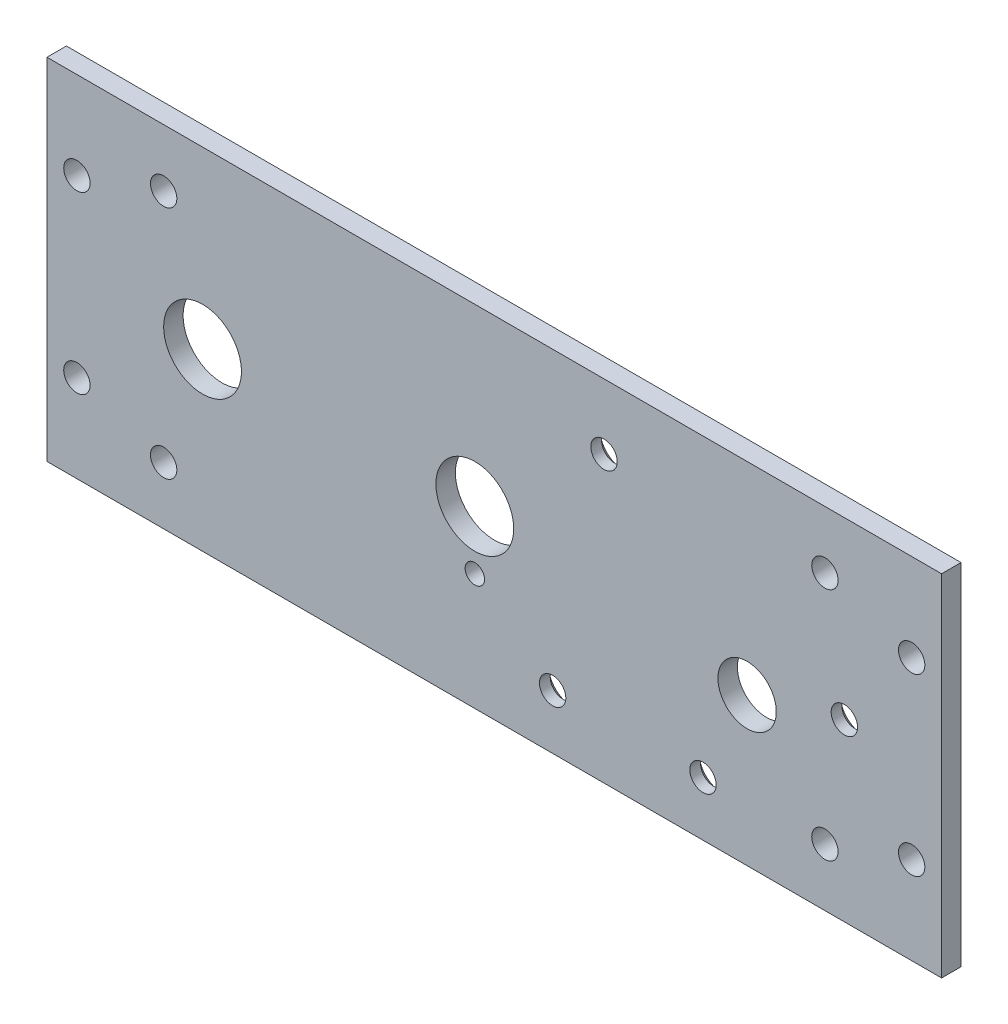
ISO-10303-21;
HEADER;
FILE_DESCRIPTION(('STEP AP214'),'2;1');
FILE_NAME('part.step','',(''),(''),'','','');
FILE_SCHEMA(('AUTOMOTIVE_DESIGN { 1 0 10303 214 1 1 1 1 }'));
ENDSEC;
DATA;
#1=APPLICATION_CONTEXT('core data for automotive mechanical design processes');
#2=APPLICATION_PROTOCOL_DEFINITION('international standard','automotive_design',2000,#1);
#3=PRODUCT_CONTEXT('',#1,'mechanical');
#4=PRODUCT('Part','Part','',(#3));
#5=PRODUCT_RELATED_PRODUCT_CATEGORY('part','',(#4));
#6=PRODUCT_DEFINITION_FORMATION('','',#4);
#7=PRODUCT_DEFINITION_CONTEXT('part definition',#1,'design');
#8=PRODUCT_DEFINITION('design','',#6,#7);
#9=PRODUCT_DEFINITION_SHAPE('','',#8);
#10=(LENGTH_UNIT() NAMED_UNIT(*) SI_UNIT(.MILLI.,.METRE.));
#11=(NAMED_UNIT(*) PLANE_ANGLE_UNIT() SI_UNIT($,.RADIAN.));
#12=(NAMED_UNIT(*) SI_UNIT($,.STERADIAN.) SOLID_ANGLE_UNIT());
#13=UNCERTAINTY_MEASURE_WITH_UNIT(LENGTH_MEASURE(1.E-05),#10,'distance_accuracy_value','');
#14=(GEOMETRIC_REPRESENTATION_CONTEXT(3) GLOBAL_UNCERTAINTY_ASSIGNED_CONTEXT((#13)) GLOBAL_UNIT_ASSIGNED_CONTEXT((#10,
#11,#12)) REPRESENTATION_CONTEXT('',''));
#15=CARTESIAN_POINT('',(0.,0.,0.));
#16=DIRECTION('',(0.,0.,1.));
#17=DIRECTION('',(1.,0.,0.));
#18=AXIS2_PLACEMENT_3D('',#15,#16,#17);
#19=CARTESIAN_POINT('',(0.,0.,-3.175));
#20=DIRECTION('',(1.,0.,0.));
#21=DIRECTION('',(0.,1.,0.));
#22=AXIS2_PLACEMENT_3D('',#19,#20,#21);
#23=PLANE('',#22);
#24=DIRECTION('',(0.,1.,0.));
#25=VECTOR('',#24,1.);
#26=CARTESIAN_POINT('',(0.,0.,0.));
#27=LINE('',#26,#25);
#28=CARTESIAN_POINT('',(0.,0.,0.));
#29=VERTEX_POINT('',#28);
#30=CARTESIAN_POINT('',(0.,57.15,0.));
#31=VERTEX_POINT('',#30);
#32=EDGE_CURVE('E99',#29,#31,#27,.T.);
#33=ORIENTED_EDGE('',*,*,#32,.F.);
#34=DIRECTION('',(0.,0.,1.));
#35=VECTOR('',#34,1.);
#36=CARTESIAN_POINT('',(0.,0.,-3.175));
#37=LINE('',#36,#35);
#38=CARTESIAN_POINT('',(0.,0.,-3.175));
#39=VERTEX_POINT('',#38);
#40=EDGE_CURVE('E11',#39,#29,#37,.T.);
#41=ORIENTED_EDGE('',*,*,#40,.F.);
#42=DIRECTION('',(0.,1.,0.));
#43=VECTOR('',#42,1.);
#44=CARTESIAN_POINT('',(0.,0.,-3.175));
#45=LINE('',#44,#43);
#46=CARTESIAN_POINT('',(0.,57.15,-3.175));
#47=VERTEX_POINT('',#46);
#48=EDGE_CURVE('E92',#39,#47,#45,.T.);
#49=ORIENTED_EDGE('',*,*,#48,.T.);
#50=DIRECTION('',(0.,0.,1.));
#51=VECTOR('',#50,1.);
#52=CARTESIAN_POINT('',(0.,57.15,-3.175));
#53=LINE('',#52,#51);
#54=EDGE_CURVE('E37',#47,#31,#53,.T.);
#55=ORIENTED_EDGE('',*,*,#54,.T.);
#56=EDGE_LOOP('',(#33,#41,#49,#55));
#57=FACE_BOUND('',#56,.T.);
#58=ADVANCED_FACE('F34',(#57),#23,.T.);
#59=CARTESIAN_POINT('',(-146.05,0.,-3.175));
#60=DIRECTION('',(0.,-1.,0.));
#61=DIRECTION('',(1.,0.,0.));
#62=AXIS2_PLACEMENT_3D('',#59,#60,#61);
#63=PLANE('',#62);
#64=DIRECTION('',(1.,0.,0.));
#65=VECTOR('',#64,1.);
#66=CARTESIAN_POINT('',(-146.05,0.,0.));
#67=LINE('',#66,#65);
#68=CARTESIAN_POINT('',(-146.05,0.,0.));
#69=VERTEX_POINT('',#68);
#70=EDGE_CURVE('E94',#69,#29,#67,.T.);
#71=ORIENTED_EDGE('',*,*,#70,.F.);
#72=DIRECTION('',(0.,0.,1.));
#73=VECTOR('',#72,1.);
#74=CARTESIAN_POINT('',(-146.05,0.,-3.175));
#75=LINE('',#74,#73);
#76=CARTESIAN_POINT('',(-146.05,0.,-3.175));
#77=VERTEX_POINT('',#76);
#78=EDGE_CURVE('E43',#77,#69,#75,.T.);
#79=ORIENTED_EDGE('',*,*,#78,.F.);
#80=DIRECTION('',(1.,0.,0.));
#81=VECTOR('',#80,1.);
#82=CARTESIAN_POINT('',(-146.05,0.,-3.175));
#83=LINE('',#82,#81);
#84=EDGE_CURVE('E89',#77,#39,#83,.T.);
#85=ORIENTED_EDGE('',*,*,#84,.T.);
#86=ORIENTED_EDGE('',*,*,#40,.T.);
#87=EDGE_LOOP('',(#71,#79,#85,#86));
#88=FACE_BOUND('',#87,.T.);
#89=ADVANCED_FACE('F110',(#88),#63,.T.);
#90=CARTESIAN_POINT('',(-146.05,57.15,-3.175));
#91=DIRECTION('',(-1.,0.,0.));
#92=DIRECTION('',(0.,0.,1.));
#93=AXIS2_PLACEMENT_3D('',#90,#91,#92);
#94=PLANE('',#93);
#95=DIRECTION('',(0.,-1.,0.));
#96=VECTOR('',#95,1.);
#97=CARTESIAN_POINT('',(-146.05,57.15,0.));
#98=LINE('',#97,#96);
#99=CARTESIAN_POINT('',(-146.05,57.15,0.));
#100=VERTEX_POINT('',#99);
#101=EDGE_CURVE('E84',#100,#69,#98,.T.);
#102=ORIENTED_EDGE('',*,*,#101,.F.);
#103=DIRECTION('',(0.,0.,1.));
#104=VECTOR('',#103,1.);
#105=CARTESIAN_POINT('',(-146.05,57.15,-3.175));
#106=LINE('',#105,#104);
#107=CARTESIAN_POINT('',(-146.05,57.15,-3.175));
#108=VERTEX_POINT('',#107);
#109=EDGE_CURVE('E79',#108,#100,#106,.T.);
#110=ORIENTED_EDGE('',*,*,#109,.F.);
#111=DIRECTION('',(0.,-1.,0.));
#112=VECTOR('',#111,1.);
#113=CARTESIAN_POINT('',(-146.05,57.15,-3.175));
#114=LINE('',#113,#112);
#115=EDGE_CURVE('E82',#108,#77,#114,.T.);
#116=ORIENTED_EDGE('',*,*,#115,.T.);
#117=ORIENTED_EDGE('',*,*,#78,.T.);
#118=EDGE_LOOP('',(#102,#110,#116,#117));
#119=FACE_BOUND('',#118,.T.);
#120=ADVANCED_FACE('F81',(#119),#94,.T.);
#121=CARTESIAN_POINT('',(0.,57.15,-3.175));
#122=DIRECTION('',(0.,1.,0.));
#123=DIRECTION('',(0.,0.,1.));
#124=AXIS2_PLACEMENT_3D('',#121,#122,#123);
#125=PLANE('',#124);
#126=DIRECTION('',(-1.,0.,0.));
#127=VECTOR('',#126,1.);
#128=CARTESIAN_POINT('',(0.,57.15,0.));
#129=LINE('',#128,#127);
#130=EDGE_CURVE('E102',#31,#100,#129,.T.);
#131=ORIENTED_EDGE('',*,*,#130,.F.);
#132=ORIENTED_EDGE('',*,*,#54,.F.);
#133=DIRECTION('',(-1.,0.,0.));
#134=VECTOR('',#133,1.);
#135=CARTESIAN_POINT('',(0.,57.15,-3.175));
#136=LINE('',#135,#134);
#137=EDGE_CURVE('E88',#47,#108,#136,.T.);
#138=ORIENTED_EDGE('',*,*,#137,.T.);
#139=ORIENTED_EDGE('',*,*,#109,.T.);
#140=EDGE_LOOP('',(#131,#132,#138,#139));
#141=FACE_BOUND('',#140,.T.);
#142=ADVANCED_FACE('F91',(#141),#125,.T.);
#143=CARTESIAN_POINT('',(0.,0.,-3.175));
#144=DIRECTION('',(0.,0.,1.));
#145=DIRECTION('',(1.,0.,0.));
#146=AXIS2_PLACEMENT_3D('',#143,#144,#145);
#147=PLANE('',#146);
#148=CARTESIAN_POINT('',(-63.5,8.89,-3.175));
#149=DIRECTION('',(0.,0.,-1.));
#150=DIRECTION('',(-1.,0.,0.));
#151=AXIS2_PLACEMENT_3D('',#148,#149,#150);
#152=CIRCLE('',#151,3.8460045);
#153=CARTESIAN_POINT('',(-67.3460045,8.89,-3.175));
#154=VERTEX_POINT('',#153);
#155=EDGE_CURVE('E218',#154,#154,#152,.T.);
#156=ORIENTED_EDGE('',*,*,#155,.F.);
#157=EDGE_LOOP('',(#156));
#158=FACE_BOUND('',#157,.T.);
#159=CARTESIAN_POINT('',(-55.1079876948826,46.4932869908067,-3.175));
#160=DIRECTION('',(0.,0.,-1.));
#161=DIRECTION('',(-1.,0.,0.));
#162=AXIS2_PLACEMENT_3D('',#159,#160,#161);
#163=CIRCLE('',#162,3.8460045);
#164=CARTESIAN_POINT('',(-58.9539921948826,46.4932869908067,-3.175));
#165=VERTEX_POINT('',#164);
#166=EDGE_CURVE('E225',#165,#165,#163,.T.);
#167=ORIENTED_EDGE('',*,*,#166,.F.);
#168=EDGE_LOOP('',(#167));
#169=FACE_BOUND('',#168,.T.);
#170=CARTESIAN_POINT('',(-15.875,28.58,-3.175));
#171=DIRECTION('',(0.,0.,-1.));
#172=DIRECTION('',(-1.,0.,0.));
#173=AXIS2_PLACEMENT_3D('',#170,#171,#172);
#174=CIRCLE('',#173,3.8460045);
#175=CARTESIAN_POINT('',(-19.7210045,28.58,-3.175));
#176=VERTEX_POINT('',#175);
#177=EDGE_CURVE('E234',#176,#176,#174,.T.);
#178=ORIENTED_EDGE('',*,*,#177,.F.);
#179=EDGE_LOOP('',(#178));
#180=FACE_BOUND('',#179,.T.);
#181=CARTESIAN_POINT('',(-38.95,8.89,-3.175));
#182=DIRECTION('',(0.,0.,-1.));
#183=DIRECTION('',(-1.,0.,0.));
#184=AXIS2_PLACEMENT_3D('',#181,#182,#183);
#185=CIRCLE('',#184,3.8460045);
#186=CARTESIAN_POINT('',(-42.7960045,8.89,-3.175));
#187=VERTEX_POINT('',#186);
#188=EDGE_CURVE('E243',#187,#187,#185,.T.);
#189=ORIENTED_EDGE('',*,*,#188,.F.);
#190=EDGE_LOOP('',(#189));
#191=FACE_BOUND('',#190,.T.);
#192=CARTESIAN_POINT('',(-76.2,19.05,-3.175));
#193=DIRECTION('',(0.,0.,-1.));
#194=DIRECTION('',(-1.,0.,0.));
#195=AXIS2_PLACEMENT_3D('',#192,#193,#194);
#196=CIRCLE('',#195,1.58750000000001);
#197=CARTESIAN_POINT('',(-77.7875,19.05,-3.175));
#198=VERTEX_POINT('',#197);
#199=EDGE_CURVE('E252',#198,#198,#196,.T.);
#200=ORIENTED_EDGE('',*,*,#199,.F.);
#201=EDGE_LOOP('',(#200));
#202=FACE_BOUND('',#201,.T.);
#203=CARTESIAN_POINT('',(-31.75,24.13,-3.175));
#204=DIRECTION('',(0.,0.,-1.));
#205=DIRECTION('',(-1.,0.,0.));
#206=AXIS2_PLACEMENT_3D('',#203,#204,#205);
#207=CIRCLE('',#206,4.7625);
#208=CARTESIAN_POINT('',(-36.5125,24.13,-3.175));
#209=VERTEX_POINT('',#208);
#210=EDGE_CURVE('E258',#209,#209,#207,.T.);
#211=ORIENTED_EDGE('',*,*,#210,.F.);
#212=EDGE_LOOP('',(#211));
#213=FACE_BOUND('',#212,.T.);
#214=CARTESIAN_POINT('',(-76.2000000000001,28.5750000000004,-3.175));
#215=DIRECTION('',(0.,0.,-1.));
#216=DIRECTION('',(-1.,0.,0.));
#217=AXIS2_PLACEMENT_3D('',#214,#215,#216);
#218=CIRCLE('',#217,6.34999999999999);
#219=CARTESIAN_POINT('',(-82.5500000000001,28.5750000000004,-3.175));
#220=VERTEX_POINT('',#219);
#221=EDGE_CURVE('E264',#220,#220,#218,.T.);
#222=ORIENTED_EDGE('',*,*,#221,.F.);
#223=EDGE_LOOP('',(#222));
#224=FACE_BOUND('',#223,.T.);
#225=CARTESIAN_POINT('',(-120.65,28.575,-3.175));
#226=DIRECTION('',(0.,0.,-1.));
#227=DIRECTION('',(-1.,0.,0.));
#228=AXIS2_PLACEMENT_3D('',#225,#226,#227);
#229=CIRCLE('',#228,6.34999999999999);
#230=CARTESIAN_POINT('',(-127.,28.575,-3.175));
#231=VERTEX_POINT('',#230);
#232=EDGE_CURVE('E270',#231,#231,#229,.T.);
#233=ORIENTED_EDGE('',*,*,#232,.F.);
#234=EDGE_LOOP('',(#233));
#235=FACE_BOUND('',#234,.T.);
#236=CARTESIAN_POINT('',(-4.88949999999997,42.8625,-3.175));
#237=DIRECTION('',(0.,0.,-1.));
#238=DIRECTION('',(-1.,0.,0.));
#239=AXIS2_PLACEMENT_3D('',#236,#237,#238);
#240=CIRCLE('',#239,2.15265);
#241=CARTESIAN_POINT('',(-7.04214999999997,42.8625,-3.175));
#242=VERTEX_POINT('',#241);
#243=EDGE_CURVE('E276',#242,#242,#240,.T.);
#244=ORIENTED_EDGE('',*,*,#243,.F.);
#245=EDGE_LOOP('',(#244));
#246=FACE_BOUND('',#245,.T.);
#247=CARTESIAN_POINT('',(-141.1605,42.8625,-3.175));
#248=DIRECTION('',(0.,0.,-1.));
#249=DIRECTION('',(-1.,0.,0.));
#250=AXIS2_PLACEMENT_3D('',#247,#248,#249);
#251=CIRCLE('',#250,2.15265000000001);
#252=CARTESIAN_POINT('',(-143.31315,42.8625,-3.175));
#253=VERTEX_POINT('',#252);
#254=EDGE_CURVE('E282',#253,#253,#251,.T.);
#255=ORIENTED_EDGE('',*,*,#254,.F.);
#256=EDGE_LOOP('',(#255));
#257=FACE_BOUND('',#256,.T.);
#258=CARTESIAN_POINT('',(-141.1605,14.2875,-3.175));
#259=DIRECTION('',(0.,0.,-1.));
#260=DIRECTION('',(-1.,0.,0.));
#261=AXIS2_PLACEMENT_3D('',#258,#259,#260);
#262=CIRCLE('',#261,2.15265000000001);
#263=CARTESIAN_POINT('',(-143.31315,14.2875,-3.175));
#264=VERTEX_POINT('',#263);
#265=EDGE_CURVE('E288',#264,#264,#262,.T.);
#266=ORIENTED_EDGE('',*,*,#265,.F.);
#267=EDGE_LOOP('',(#266));
#268=FACE_BOUND('',#267,.T.);
#269=CARTESIAN_POINT('',(-4.88949999999995,14.2875,-3.175));
#270=DIRECTION('',(0.,0.,-1.));
#271=DIRECTION('',(-1.,0.,0.));
#272=AXIS2_PLACEMENT_3D('',#269,#270,#271);
#273=CIRCLE('',#272,2.15265);
#274=CARTESIAN_POINT('',(-7.04214999999995,14.2875,-3.175));
#275=VERTEX_POINT('',#274);
#276=EDGE_CURVE('E294',#275,#275,#273,.T.);
#277=ORIENTED_EDGE('',*,*,#276,.F.);
#278=EDGE_LOOP('',(#277));
#279=FACE_BOUND('',#278,.T.);
#280=CARTESIAN_POINT('',(-19.05,47.752,-3.175));
#281=DIRECTION('',(0.,0.,-1.));
#282=DIRECTION('',(-1.,0.,0.));
#283=AXIS2_PLACEMENT_3D('',#280,#281,#282);
#284=CIRCLE('',#283,2.15265);
#285=CARTESIAN_POINT('',(-21.20265,47.752,-3.175));
#286=VERTEX_POINT('',#285);
#287=EDGE_CURVE('E300',#286,#286,#284,.T.);
#288=ORIENTED_EDGE('',*,*,#287,.F.);
#289=EDGE_LOOP('',(#288));
#290=FACE_BOUND('',#289,.T.);
#291=CARTESIAN_POINT('',(-19.05,9.398,-3.175));
#292=DIRECTION('',(0.,0.,-1.));
#293=DIRECTION('',(-1.,0.,0.));
#294=AXIS2_PLACEMENT_3D('',#291,#292,#293);
#295=CIRCLE('',#294,2.15265);
#296=CARTESIAN_POINT('',(-21.20265,9.398,-3.175));
#297=VERTEX_POINT('',#296);
#298=EDGE_CURVE('E306',#297,#297,#295,.T.);
#299=ORIENTED_EDGE('',*,*,#298,.F.);
#300=EDGE_LOOP('',(#299));
#301=FACE_BOUND('',#300,.T.);
#302=CARTESIAN_POINT('',(-127.,9.398,-3.175));
#303=DIRECTION('',(0.,0.,-1.));
#304=DIRECTION('',(-1.,0.,0.));
#305=AXIS2_PLACEMENT_3D('',#302,#303,#304);
#306=CIRCLE('',#305,2.15265000000001);
#307=CARTESIAN_POINT('',(-129.15265,9.398,-3.175));
#308=VERTEX_POINT('',#307);
#309=EDGE_CURVE('E312',#308,#308,#306,.T.);
#310=ORIENTED_EDGE('',*,*,#309,.F.);
#311=EDGE_LOOP('',(#310));
#312=FACE_BOUND('',#311,.T.);
#313=CARTESIAN_POINT('',(-127.,47.752,-3.175));
#314=DIRECTION('',(0.,0.,-1.));
#315=DIRECTION('',(-1.,0.,0.));
#316=AXIS2_PLACEMENT_3D('',#313,#314,#315);
#317=CIRCLE('',#316,2.15265000000001);
#318=CARTESIAN_POINT('',(-129.15265,47.752,-3.175));
#319=VERTEX_POINT('',#318);
#320=EDGE_CURVE('E318',#319,#319,#317,.T.);
#321=ORIENTED_EDGE('',*,*,#320,.F.);
#322=EDGE_LOOP('',(#321));
#323=FACE_BOUND('',#322,.T.);
#324=ORIENTED_EDGE('',*,*,#48,.F.);
#325=ORIENTED_EDGE('',*,*,#84,.F.);
#326=ORIENTED_EDGE('',*,*,#115,.F.);
#327=ORIENTED_EDGE('',*,*,#137,.F.);
#328=EDGE_LOOP('',(#324,#325,#326,#327));
#329=FACE_BOUND('',#328,.T.);
#330=ADVANCED_FACE('F87',(#158,#169,#180,#191,#202,#213,#224,#235,#246,#257,#268,#279,#290,#301,
#312,#323,#329),#147,.F.);
#331=CARTESIAN_POINT('',(0.,0.,0.));
#332=DIRECTION('',(0.,0.,1.));
#333=DIRECTION('',(1.,0.,0.));
#334=AXIS2_PLACEMENT_3D('',#331,#332,#333);
#335=PLANE('',#334);
#336=CARTESIAN_POINT('',(-63.5,8.89,0.));
#337=DIRECTION('',(0.,0.,-1.));
#338=DIRECTION('',(-1.,0.,0.));
#339=AXIS2_PLACEMENT_3D('',#336,#337,#338);
#340=CIRCLE('',#339,2.15265);
#341=CARTESIAN_POINT('',(-65.65265,8.89,0.));
#342=VERTEX_POINT('',#341);
#343=EDGE_CURVE('E220',#342,#342,#340,.T.);
#344=ORIENTED_EDGE('',*,*,#343,.T.);
#345=EDGE_LOOP('',(#344));
#346=FACE_BOUND('',#345,.T.);
#347=CARTESIAN_POINT('',(-55.1079876948826,46.4932869908067,0.));
#348=DIRECTION('',(0.,0.,-1.));
#349=DIRECTION('',(-1.,0.,0.));
#350=AXIS2_PLACEMENT_3D('',#347,#348,#349);
#351=CIRCLE('',#350,2.15265);
#352=CARTESIAN_POINT('',(-57.2606376948826,46.4932869908067,0.));
#353=VERTEX_POINT('',#352);
#354=EDGE_CURVE('E231',#353,#353,#351,.T.);
#355=ORIENTED_EDGE('',*,*,#354,.T.);
#356=EDGE_LOOP('',(#355));
#357=FACE_BOUND('',#356,.T.);
#358=CARTESIAN_POINT('',(-15.875,28.58,0.));
#359=DIRECTION('',(0.,0.,-1.));
#360=DIRECTION('',(-1.,0.,0.));
#361=AXIS2_PLACEMENT_3D('',#358,#359,#360);
#362=CIRCLE('',#361,2.15265);
#363=CARTESIAN_POINT('',(-18.02765,28.58,0.));
#364=VERTEX_POINT('',#363);
#365=EDGE_CURVE('E240',#364,#364,#362,.T.);
#366=ORIENTED_EDGE('',*,*,#365,.T.);
#367=EDGE_LOOP('',(#366));
#368=FACE_BOUND('',#367,.T.);
#369=CARTESIAN_POINT('',(-38.95,8.89,0.));
#370=DIRECTION('',(0.,0.,-1.));
#371=DIRECTION('',(-1.,0.,0.));
#372=AXIS2_PLACEMENT_3D('',#369,#370,#371);
#373=CIRCLE('',#372,2.15265);
#374=CARTESIAN_POINT('',(-41.10265,8.89,0.));
#375=VERTEX_POINT('',#374);
#376=EDGE_CURVE('E249',#375,#375,#373,.T.);
#377=ORIENTED_EDGE('',*,*,#376,.T.);
#378=EDGE_LOOP('',(#377));
#379=FACE_BOUND('',#378,.T.);
#380=CARTESIAN_POINT('',(-76.2,19.05,0.));
#381=DIRECTION('',(0.,0.,-1.));
#382=DIRECTION('',(-1.,0.,0.));
#383=AXIS2_PLACEMENT_3D('',#380,#381,#382);
#384=CIRCLE('',#383,1.58750000000001);
#385=CARTESIAN_POINT('',(-77.7875,19.05,0.));
#386=VERTEX_POINT('',#385);
#387=EDGE_CURVE('E255',#386,#386,#384,.T.);
#388=ORIENTED_EDGE('',*,*,#387,.T.);
#389=EDGE_LOOP('',(#388));
#390=FACE_BOUND('',#389,.T.);
#391=CARTESIAN_POINT('',(-31.75,24.13,0.));
#392=DIRECTION('',(0.,0.,-1.));
#393=DIRECTION('',(-1.,0.,0.));
#394=AXIS2_PLACEMENT_3D('',#391,#392,#393);
#395=CIRCLE('',#394,4.7625);
#396=CARTESIAN_POINT('',(-36.5125,24.13,0.));
#397=VERTEX_POINT('',#396);
#398=EDGE_CURVE('E261',#397,#397,#395,.T.);
#399=ORIENTED_EDGE('',*,*,#398,.T.);
#400=EDGE_LOOP('',(#399));
#401=FACE_BOUND('',#400,.T.);
#402=CARTESIAN_POINT('',(-76.2000000000001,28.5750000000004,0.));
#403=DIRECTION('',(0.,0.,-1.));
#404=DIRECTION('',(-1.,0.,0.));
#405=AXIS2_PLACEMENT_3D('',#402,#403,#404);
#406=CIRCLE('',#405,6.34999999999999);
#407=CARTESIAN_POINT('',(-82.5500000000001,28.5750000000004,0.));
#408=VERTEX_POINT('',#407);
#409=EDGE_CURVE('E267',#408,#408,#406,.T.);
#410=ORIENTED_EDGE('',*,*,#409,.T.);
#411=EDGE_LOOP('',(#410));
#412=FACE_BOUND('',#411,.T.);
#413=CARTESIAN_POINT('',(-120.65,28.575,0.));
#414=DIRECTION('',(0.,0.,-1.));
#415=DIRECTION('',(-1.,0.,0.));
#416=AXIS2_PLACEMENT_3D('',#413,#414,#415);
#417=CIRCLE('',#416,6.34999999999999);
#418=CARTESIAN_POINT('',(-127.,28.575,0.));
#419=VERTEX_POINT('',#418);
#420=EDGE_CURVE('E273',#419,#419,#417,.T.);
#421=ORIENTED_EDGE('',*,*,#420,.T.);
#422=EDGE_LOOP('',(#421));
#423=FACE_BOUND('',#422,.T.);
#424=CARTESIAN_POINT('',(-4.88949999999997,42.8625,0.));
#425=DIRECTION('',(0.,0.,-1.));
#426=DIRECTION('',(-1.,0.,0.));
#427=AXIS2_PLACEMENT_3D('',#424,#425,#426);
#428=CIRCLE('',#427,2.15265);
#429=CARTESIAN_POINT('',(-7.04214999999997,42.8625,0.));
#430=VERTEX_POINT('',#429);
#431=EDGE_CURVE('E279',#430,#430,#428,.T.);
#432=ORIENTED_EDGE('',*,*,#431,.T.);
#433=EDGE_LOOP('',(#432));
#434=FACE_BOUND('',#433,.T.);
#435=CARTESIAN_POINT('',(-141.1605,42.8625,0.));
#436=DIRECTION('',(0.,0.,-1.));
#437=DIRECTION('',(-1.,0.,0.));
#438=AXIS2_PLACEMENT_3D('',#435,#436,#437);
#439=CIRCLE('',#438,2.15265000000001);
#440=CARTESIAN_POINT('',(-143.31315,42.8625,0.));
#441=VERTEX_POINT('',#440);
#442=EDGE_CURVE('E285',#441,#441,#439,.T.);
#443=ORIENTED_EDGE('',*,*,#442,.T.);
#444=EDGE_LOOP('',(#443));
#445=FACE_BOUND('',#444,.T.);
#446=CARTESIAN_POINT('',(-141.1605,14.2875,0.));
#447=DIRECTION('',(0.,0.,-1.));
#448=DIRECTION('',(-1.,0.,0.));
#449=AXIS2_PLACEMENT_3D('',#446,#447,#448);
#450=CIRCLE('',#449,2.15265000000001);
#451=CARTESIAN_POINT('',(-143.31315,14.2875,0.));
#452=VERTEX_POINT('',#451);
#453=EDGE_CURVE('E291',#452,#452,#450,.T.);
#454=ORIENTED_EDGE('',*,*,#453,.T.);
#455=EDGE_LOOP('',(#454));
#456=FACE_BOUND('',#455,.T.);
#457=CARTESIAN_POINT('',(-4.88949999999995,14.2875,0.));
#458=DIRECTION('',(0.,0.,-1.));
#459=DIRECTION('',(-1.,0.,0.));
#460=AXIS2_PLACEMENT_3D('',#457,#458,#459);
#461=CIRCLE('',#460,2.15265);
#462=CARTESIAN_POINT('',(-7.04214999999995,14.2875,0.));
#463=VERTEX_POINT('',#462);
#464=EDGE_CURVE('E297',#463,#463,#461,.T.);
#465=ORIENTED_EDGE('',*,*,#464,.T.);
#466=EDGE_LOOP('',(#465));
#467=FACE_BOUND('',#466,.T.);
#468=CARTESIAN_POINT('',(-19.05,47.752,0.));
#469=DIRECTION('',(0.,0.,-1.));
#470=DIRECTION('',(-1.,0.,0.));
#471=AXIS2_PLACEMENT_3D('',#468,#469,#470);
#472=CIRCLE('',#471,2.15265);
#473=CARTESIAN_POINT('',(-21.20265,47.752,0.));
#474=VERTEX_POINT('',#473);
#475=EDGE_CURVE('E303',#474,#474,#472,.T.);
#476=ORIENTED_EDGE('',*,*,#475,.T.);
#477=EDGE_LOOP('',(#476));
#478=FACE_BOUND('',#477,.T.);
#479=CARTESIAN_POINT('',(-19.05,9.398,0.));
#480=DIRECTION('',(0.,0.,-1.));
#481=DIRECTION('',(-1.,0.,0.));
#482=AXIS2_PLACEMENT_3D('',#479,#480,#481);
#483=CIRCLE('',#482,2.15265);
#484=CARTESIAN_POINT('',(-21.20265,9.398,0.));
#485=VERTEX_POINT('',#484);
#486=EDGE_CURVE('E309',#485,#485,#483,.T.);
#487=ORIENTED_EDGE('',*,*,#486,.T.);
#488=EDGE_LOOP('',(#487));
#489=FACE_BOUND('',#488,.T.);
#490=CARTESIAN_POINT('',(-127.,9.398,0.));
#491=DIRECTION('',(0.,0.,-1.));
#492=DIRECTION('',(-1.,0.,0.));
#493=AXIS2_PLACEMENT_3D('',#490,#491,#492);
#494=CIRCLE('',#493,2.15265000000001);
#495=CARTESIAN_POINT('',(-129.15265,9.398,0.));
#496=VERTEX_POINT('',#495);
#497=EDGE_CURVE('E315',#496,#496,#494,.T.);
#498=ORIENTED_EDGE('',*,*,#497,.T.);
#499=EDGE_LOOP('',(#498));
#500=FACE_BOUND('',#499,.T.);
#501=CARTESIAN_POINT('',(-127.,47.752,0.));
#502=DIRECTION('',(0.,0.,-1.));
#503=DIRECTION('',(-1.,0.,0.));
#504=AXIS2_PLACEMENT_3D('',#501,#502,#503);
#505=CIRCLE('',#504,2.15265000000001);
#506=CARTESIAN_POINT('',(-129.15265,47.752,0.));
#507=VERTEX_POINT('',#506);
#508=EDGE_CURVE('E103',#507,#507,#505,.T.);
#509=ORIENTED_EDGE('',*,*,#508,.T.);
#510=EDGE_LOOP('',(#509));
#511=FACE_BOUND('',#510,.T.);
#512=ORIENTED_EDGE('',*,*,#32,.T.);
#513=ORIENTED_EDGE('',*,*,#130,.T.);
#514=ORIENTED_EDGE('',*,*,#101,.T.);
#515=ORIENTED_EDGE('',*,*,#70,.T.);
#516=EDGE_LOOP('',(#512,#513,#514,#515));
#517=FACE_BOUND('',#516,.T.);
#518=ADVANCED_FACE('F109',(#346,#357,#368,#379,#390,#401,#412,#423,#434,#445,#456,#467,#478,
#489,#500,#511,#517),#335,.T.);
#519=CARTESIAN_POINT('',(-127.,47.752,-3.175));
#520=DIRECTION('',(0.,0.,-1.));
#521=DIRECTION('',(-1.,0.,0.));
#522=AXIS2_PLACEMENT_3D('',#519,#520,#521);
#523=CYLINDRICAL_SURFACE('',#522,2.15265000000001);
#524=ORIENTED_EDGE('',*,*,#508,.F.);
#525=EDGE_LOOP('',(#524));
#526=FACE_BOUND('',#525,.T.);
#527=ORIENTED_EDGE('',*,*,#320,.T.);
#528=EDGE_LOOP('',(#527));
#529=FACE_BOUND('',#528,.T.);
#530=ADVANCED_FACE('F128',(#526,#529),#523,.F.);
#531=CARTESIAN_POINT('',(-127.,9.398,-3.175));
#532=DIRECTION('',(0.,0.,-1.));
#533=DIRECTION('',(-1.,0.,0.));
#534=AXIS2_PLACEMENT_3D('',#531,#532,#533);
#535=CYLINDRICAL_SURFACE('',#534,2.15265000000001);
#536=ORIENTED_EDGE('',*,*,#497,.F.);
#537=EDGE_LOOP('',(#536));
#538=FACE_BOUND('',#537,.T.);
#539=ORIENTED_EDGE('',*,*,#309,.T.);
#540=EDGE_LOOP('',(#539));
#541=FACE_BOUND('',#540,.T.);
#542=ADVANCED_FACE('F135',(#538,#541),#535,.F.);
#543=CARTESIAN_POINT('',(-19.05,9.398,-3.175));
#544=DIRECTION('',(0.,0.,-1.));
#545=DIRECTION('',(-1.,0.,0.));
#546=AXIS2_PLACEMENT_3D('',#543,#544,#545);
#547=CYLINDRICAL_SURFACE('',#546,2.15265);
#548=ORIENTED_EDGE('',*,*,#486,.F.);
#549=EDGE_LOOP('',(#548));
#550=FACE_BOUND('',#549,.T.);
#551=ORIENTED_EDGE('',*,*,#298,.T.);
#552=EDGE_LOOP('',(#551));
#553=FACE_BOUND('',#552,.T.);
#554=ADVANCED_FACE('F139',(#550,#553),#547,.F.);
#555=CARTESIAN_POINT('',(-19.05,47.752,-3.175));
#556=DIRECTION('',(0.,0.,-1.));
#557=DIRECTION('',(-1.,0.,0.));
#558=AXIS2_PLACEMENT_3D('',#555,#556,#557);
#559=CYLINDRICAL_SURFACE('',#558,2.15265);
#560=ORIENTED_EDGE('',*,*,#475,.F.);
#561=EDGE_LOOP('',(#560));
#562=FACE_BOUND('',#561,.T.);
#563=ORIENTED_EDGE('',*,*,#287,.T.);
#564=EDGE_LOOP('',(#563));
#565=FACE_BOUND('',#564,.T.);
#566=ADVANCED_FACE('F143',(#562,#565),#559,.F.);
#567=CARTESIAN_POINT('',(-4.88949999999995,14.2875,-3.175));
#568=DIRECTION('',(0.,0.,-1.));
#569=DIRECTION('',(-1.,0.,0.));
#570=AXIS2_PLACEMENT_3D('',#567,#568,#569);
#571=CYLINDRICAL_SURFACE('',#570,2.15265);
#572=ORIENTED_EDGE('',*,*,#464,.F.);
#573=EDGE_LOOP('',(#572));
#574=FACE_BOUND('',#573,.T.);
#575=ORIENTED_EDGE('',*,*,#276,.T.);
#576=EDGE_LOOP('',(#575));
#577=FACE_BOUND('',#576,.T.);
#578=ADVANCED_FACE('F147',(#574,#577),#571,.F.);
#579=CARTESIAN_POINT('',(-141.1605,14.2875,-3.175));
#580=DIRECTION('',(0.,0.,-1.));
#581=DIRECTION('',(-1.,0.,0.));
#582=AXIS2_PLACEMENT_3D('',#579,#580,#581);
#583=CYLINDRICAL_SURFACE('',#582,2.15265000000001);
#584=ORIENTED_EDGE('',*,*,#453,.F.);
#585=EDGE_LOOP('',(#584));
#586=FACE_BOUND('',#585,.T.);
#587=ORIENTED_EDGE('',*,*,#265,.T.);
#588=EDGE_LOOP('',(#587));
#589=FACE_BOUND('',#588,.T.);
#590=ADVANCED_FACE('F151',(#586,#589),#583,.F.);
#591=CARTESIAN_POINT('',(-141.1605,42.8625,-3.175));
#592=DIRECTION('',(0.,0.,-1.));
#593=DIRECTION('',(-1.,0.,0.));
#594=AXIS2_PLACEMENT_3D('',#591,#592,#593);
#595=CYLINDRICAL_SURFACE('',#594,2.15265000000001);
#596=ORIENTED_EDGE('',*,*,#442,.F.);
#597=EDGE_LOOP('',(#596));
#598=FACE_BOUND('',#597,.T.);
#599=ORIENTED_EDGE('',*,*,#254,.T.);
#600=EDGE_LOOP('',(#599));
#601=FACE_BOUND('',#600,.T.);
#602=ADVANCED_FACE('F155',(#598,#601),#595,.F.);
#603=CARTESIAN_POINT('',(-4.88949999999997,42.8625,-3.175));
#604=DIRECTION('',(0.,0.,-1.));
#605=DIRECTION('',(-1.,0.,0.));
#606=AXIS2_PLACEMENT_3D('',#603,#604,#605);
#607=CYLINDRICAL_SURFACE('',#606,2.15265);
#608=ORIENTED_EDGE('',*,*,#431,.F.);
#609=EDGE_LOOP('',(#608));
#610=FACE_BOUND('',#609,.T.);
#611=ORIENTED_EDGE('',*,*,#243,.T.);
#612=EDGE_LOOP('',(#611));
#613=FACE_BOUND('',#612,.T.);
#614=ADVANCED_FACE('F159',(#610,#613),#607,.F.);
#615=CARTESIAN_POINT('',(-120.65,28.575,-3.175));
#616=DIRECTION('',(0.,0.,-1.));
#617=DIRECTION('',(-1.,0.,0.));
#618=AXIS2_PLACEMENT_3D('',#615,#616,#617);
#619=CYLINDRICAL_SURFACE('',#618,6.34999999999999);
#620=ORIENTED_EDGE('',*,*,#420,.F.);
#621=EDGE_LOOP('',(#620));
#622=FACE_BOUND('',#621,.T.);
#623=ORIENTED_EDGE('',*,*,#232,.T.);
#624=EDGE_LOOP('',(#623));
#625=FACE_BOUND('',#624,.T.);
#626=ADVANCED_FACE('F163',(#622,#625),#619,.F.);
#627=CARTESIAN_POINT('',(-76.2000000000001,28.5750000000004,-3.175));
#628=DIRECTION('',(0.,0.,-1.));
#629=DIRECTION('',(-1.,0.,0.));
#630=AXIS2_PLACEMENT_3D('',#627,#628,#629);
#631=CYLINDRICAL_SURFACE('',#630,6.34999999999999);
#632=ORIENTED_EDGE('',*,*,#409,.F.);
#633=EDGE_LOOP('',(#632));
#634=FACE_BOUND('',#633,.T.);
#635=ORIENTED_EDGE('',*,*,#221,.T.);
#636=EDGE_LOOP('',(#635));
#637=FACE_BOUND('',#636,.T.);
#638=ADVANCED_FACE('F167',(#634,#637),#631,.F.);
#639=CARTESIAN_POINT('',(-31.75,24.13,-3.175));
#640=DIRECTION('',(0.,0.,-1.));
#641=DIRECTION('',(-1.,0.,0.));
#642=AXIS2_PLACEMENT_3D('',#639,#640,#641);
#643=CYLINDRICAL_SURFACE('',#642,4.7625);
#644=ORIENTED_EDGE('',*,*,#398,.F.);
#645=EDGE_LOOP('',(#644));
#646=FACE_BOUND('',#645,.T.);
#647=ORIENTED_EDGE('',*,*,#210,.T.);
#648=EDGE_LOOP('',(#647));
#649=FACE_BOUND('',#648,.T.);
#650=ADVANCED_FACE('F171',(#646,#649),#643,.F.);
#651=CARTESIAN_POINT('',(-76.2,19.05,-3.175));
#652=DIRECTION('',(0.,0.,-1.));
#653=DIRECTION('',(-1.,0.,0.));
#654=AXIS2_PLACEMENT_3D('',#651,#652,#653);
#655=CYLINDRICAL_SURFACE('',#654,1.58750000000001);
#656=ORIENTED_EDGE('',*,*,#387,.F.);
#657=EDGE_LOOP('',(#656));
#658=FACE_BOUND('',#657,.T.);
#659=ORIENTED_EDGE('',*,*,#199,.T.);
#660=EDGE_LOOP('',(#659));
#661=FACE_BOUND('',#660,.T.);
#662=ADVANCED_FACE('F175',(#658,#661),#655,.F.);
#663=CARTESIAN_POINT('',(-38.95,8.89,-3.175));
#664=DIRECTION('',(0.,0.,-1.));
#665=DIRECTION('',(-1.,0.,0.));
#666=AXIS2_PLACEMENT_3D('',#663,#664,#665);
#667=CYLINDRICAL_SURFACE('',#666,2.15265);
#668=ORIENTED_EDGE('',*,*,#376,.F.);
#669=EDGE_LOOP('',(#668));
#670=FACE_BOUND('',#669,.T.);
#671=CARTESIAN_POINT('',(-38.95,8.89,-1.7541068635976));
#672=DIRECTION('',(0.,0.,-1.));
#673=DIRECTION('',(-1.,0.,0.));
#674=AXIS2_PLACEMENT_3D('',#671,#672,#673);
#675=CIRCLE('',#674,2.15264999999999);
#676=CARTESIAN_POINT('',(-41.10265,8.89,-1.7541068635976));
#677=VERTEX_POINT('',#676);
#678=EDGE_CURVE('E246',#677,#677,#675,.T.);
#679=ORIENTED_EDGE('',*,*,#678,.T.);
#680=EDGE_LOOP('',(#679));
#681=FACE_BOUND('',#680,.T.);
#682=ADVANCED_FACE('F179',(#670,#681),#667,.F.);
#683=CARTESIAN_POINT('',(-38.95,8.89,-3.175));
#684=DIRECTION('',(0.,0.,-1.));
#685=DIRECTION('',(-1.,0.,0.));
#686=AXIS2_PLACEMENT_3D('',#683,#684,#685);
#687=CONICAL_SURFACE('',#686,3.8460045,0.872664625997164);
#688=ORIENTED_EDGE('',*,*,#678,.F.);
#689=EDGE_LOOP('',(#688));
#690=FACE_BOUND('',#689,.T.);
#691=ORIENTED_EDGE('',*,*,#188,.T.);
#692=EDGE_LOOP('',(#691));
#693=FACE_BOUND('',#692,.T.);
#694=ADVANCED_FACE('F183',(#690,#693),#687,.F.);
#695=CARTESIAN_POINT('',(-15.875,28.58,-3.175));
#696=DIRECTION('',(0.,0.,-1.));
#697=DIRECTION('',(-1.,0.,0.));
#698=AXIS2_PLACEMENT_3D('',#695,#696,#697);
#699=CYLINDRICAL_SURFACE('',#698,2.15264999999999);
#700=ORIENTED_EDGE('',*,*,#365,.F.);
#701=EDGE_LOOP('',(#700));
#702=FACE_BOUND('',#701,.T.);
#703=CARTESIAN_POINT('',(-15.875,28.58,-1.7541068635976));
#704=DIRECTION('',(0.,0.,-1.));
#705=DIRECTION('',(-1.,0.,0.));
#706=AXIS2_PLACEMENT_3D('',#703,#704,#705);
#707=CIRCLE('',#706,2.15264999999999);
#708=CARTESIAN_POINT('',(-18.02765,28.58,-1.7541068635976));
#709=VERTEX_POINT('',#708);
#710=EDGE_CURVE('E237',#709,#709,#707,.T.);
#711=ORIENTED_EDGE('',*,*,#710,.T.);
#712=EDGE_LOOP('',(#711));
#713=FACE_BOUND('',#712,.T.);
#714=ADVANCED_FACE('F187',(#702,#713),#699,.F.);
#715=CARTESIAN_POINT('',(-15.875,28.58,-3.175));
#716=DIRECTION('',(0.,0.,-1.));
#717=DIRECTION('',(-1.,0.,0.));
#718=AXIS2_PLACEMENT_3D('',#715,#716,#717);
#719=CONICAL_SURFACE('',#718,3.8460045,0.872664625997165);
#720=ORIENTED_EDGE('',*,*,#710,.F.);
#721=EDGE_LOOP('',(#720));
#722=FACE_BOUND('',#721,.T.);
#723=ORIENTED_EDGE('',*,*,#177,.T.);
#724=EDGE_LOOP('',(#723));
#725=FACE_BOUND('',#724,.T.);
#726=ADVANCED_FACE('F191',(#722,#725),#719,.F.);
#727=CARTESIAN_POINT('',(-55.1079876948826,46.4932869908067,-3.175));
#728=DIRECTION('',(0.,0.,-1.));
#729=DIRECTION('',(-1.,0.,0.));
#730=AXIS2_PLACEMENT_3D('',#727,#728,#729);
#731=CYLINDRICAL_SURFACE('',#730,2.15265);
#732=ORIENTED_EDGE('',*,*,#354,.F.);
#733=EDGE_LOOP('',(#732));
#734=FACE_BOUND('',#733,.T.);
#735=CARTESIAN_POINT('',(-55.1079876948826,46.4932869908067,-1.7541068635976));
#736=DIRECTION('',(0.,0.,-1.));
#737=DIRECTION('',(-1.,0.,0.));
#738=AXIS2_PLACEMENT_3D('',#735,#736,#737);
#739=CIRCLE('',#738,2.15264999999999);
#740=CARTESIAN_POINT('',(-57.2606376948826,46.4932869908067,-1.7541068635976));
#741=VERTEX_POINT('',#740);
#742=EDGE_CURVE('E228',#741,#741,#739,.T.);
#743=ORIENTED_EDGE('',*,*,#742,.T.);
#744=EDGE_LOOP('',(#743));
#745=FACE_BOUND('',#744,.T.);
#746=ADVANCED_FACE('F195',(#734,#745),#731,.F.);
#747=CARTESIAN_POINT('',(-55.1079876948826,46.4932869908067,-3.175));
#748=DIRECTION('',(0.,0.,-1.));
#749=DIRECTION('',(-1.,0.,0.));
#750=AXIS2_PLACEMENT_3D('',#747,#748,#749);
#751=CONICAL_SURFACE('',#750,3.8460045,0.872664625997164);
#752=ORIENTED_EDGE('',*,*,#742,.F.);
#753=EDGE_LOOP('',(#752));
#754=FACE_BOUND('',#753,.T.);
#755=ORIENTED_EDGE('',*,*,#166,.T.);
#756=EDGE_LOOP('',(#755));
#757=FACE_BOUND('',#756,.T.);
#758=ADVANCED_FACE('F199',(#754,#757),#751,.F.);
#759=CARTESIAN_POINT('',(-63.5,8.89,-3.175));
#760=DIRECTION('',(0.,0.,-1.));
#761=DIRECTION('',(-1.,0.,0.));
#762=AXIS2_PLACEMENT_3D('',#759,#760,#761);
#763=CYLINDRICAL_SURFACE('',#762,2.15265);
#764=ORIENTED_EDGE('',*,*,#343,.F.);
#765=EDGE_LOOP('',(#764));
#766=FACE_BOUND('',#765,.T.);
#767=CARTESIAN_POINT('',(-63.5,8.89,-1.7541068635976));
#768=DIRECTION('',(0.,0.,-1.));
#769=DIRECTION('',(-1.,0.,0.));
#770=AXIS2_PLACEMENT_3D('',#767,#768,#769);
#771=CIRCLE('',#770,2.15264999999999);
#772=CARTESIAN_POINT('',(-65.65265,8.89,-1.7541068635976));
#773=VERTEX_POINT('',#772);
#774=EDGE_CURVE('E216',#773,#773,#771,.T.);
#775=ORIENTED_EDGE('',*,*,#774,.T.);
#776=EDGE_LOOP('',(#775));
#777=FACE_BOUND('',#776,.T.);
#778=ADVANCED_FACE('F203',(#766,#777),#763,.F.);
#779=CARTESIAN_POINT('',(-63.5,8.89,-3.175));
#780=DIRECTION('',(0.,0.,-1.));
#781=DIRECTION('',(-1.,0.,0.));
#782=AXIS2_PLACEMENT_3D('',#779,#780,#781);
#783=CONICAL_SURFACE('',#782,3.8460045,0.872664625997164);
#784=ORIENTED_EDGE('',*,*,#774,.F.);
#785=EDGE_LOOP('',(#784));
#786=FACE_BOUND('',#785,.T.);
#787=ORIENTED_EDGE('',*,*,#155,.T.);
#788=EDGE_LOOP('',(#787));
#789=FACE_BOUND('',#788,.T.);
#790=ADVANCED_FACE('F207',(#786,#789),#783,.F.);
#791=CLOSED_SHELL('',(#58,#89,#120,#142,#330,#518,#530,#542,#554,#566,#578,#590,#602,#614,#626,
#638,#650,#662,#682,#694,#714,#726,#746,#758,#778,#790));
#792=MANIFOLD_SOLID_BREP('B2',#791);
#793=ADVANCED_BREP_SHAPE_REPRESENTATION('',(#18,#792),#14);
#794=SHAPE_DEFINITION_REPRESENTATION(#9,#793);
ENDSEC;
END-ISO-10303-21;
